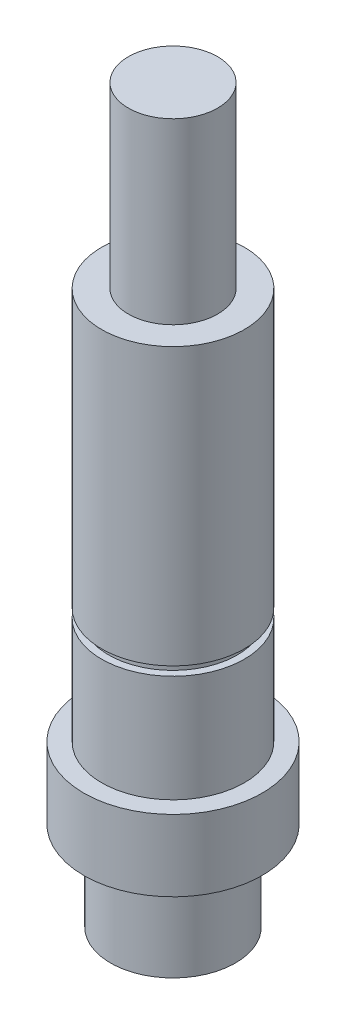
ISO-10303-21;
HEADER;
FILE_DESCRIPTION(('STEP AP214'),'2;1');
FILE_NAME('part.step','',(''),(''),'','','');
FILE_SCHEMA(('AUTOMOTIVE_DESIGN { 1 0 10303 214 1 1 1 1 }'));
ENDSEC;
DATA;
#1=APPLICATION_CONTEXT('core data for automotive mechanical design processes');
#2=APPLICATION_PROTOCOL_DEFINITION('international standard','automotive_design',2000,#1);
#3=PRODUCT_CONTEXT('',#1,'mechanical');
#4=PRODUCT('Part','Part','',(#3));
#5=PRODUCT_RELATED_PRODUCT_CATEGORY('part','',(#4));
#6=PRODUCT_DEFINITION_FORMATION('','',#4);
#7=PRODUCT_DEFINITION_CONTEXT('part definition',#1,'design');
#8=PRODUCT_DEFINITION('design','',#6,#7);
#9=PRODUCT_DEFINITION_SHAPE('','',#8);
#10=(LENGTH_UNIT() NAMED_UNIT(*) SI_UNIT(.MILLI.,.METRE.));
#11=(NAMED_UNIT(*) PLANE_ANGLE_UNIT() SI_UNIT($,.RADIAN.));
#12=(NAMED_UNIT(*) SI_UNIT($,.STERADIAN.) SOLID_ANGLE_UNIT());
#13=UNCERTAINTY_MEASURE_WITH_UNIT(LENGTH_MEASURE(1.E-05),#10,'distance_accuracy_value','');
#14=(GEOMETRIC_REPRESENTATION_CONTEXT(3) GLOBAL_UNCERTAINTY_ASSIGNED_CONTEXT((#13)) GLOBAL_UNIT_ASSIGNED_CONTEXT((#10,
#11,#12)) REPRESENTATION_CONTEXT('',''));
#15=CARTESIAN_POINT('',(0.,0.,0.));
#16=DIRECTION('',(0.,0.,1.));
#17=DIRECTION('',(1.,0.,0.));
#18=AXIS2_PLACEMENT_3D('',#15,#16,#17);
#19=CARTESIAN_POINT('',(-2.4451521004791,34.1954022988506,0.));
#20=DIRECTION('',(0.,-1.,0.));
#21=DIRECTION('',(0.,0.,-1.));
#22=AXIS2_PLACEMENT_3D('',#19,#20,#21);
#23=PLANE('',#22);
#24=CARTESIAN_POINT('',(0.054847899520899,34.1954022988506,0.));
#25=DIRECTION('',(0.,-1.,0.));
#26=DIRECTION('',(0.,0.,-1.));
#27=AXIS2_PLACEMENT_3D('',#24,#25,#26);
#28=CIRCLE('',#27,2.5);
#29=CARTESIAN_POINT('',(0.054847899520899,34.1954022988506,-2.5));
#30=VERTEX_POINT('',#29);
#31=EDGE_CURVE('E10',#30,#30,#28,.T.);
#32=ORIENTED_EDGE('',*,*,#31,.F.);
#33=EDGE_LOOP('',(#32));
#34=FACE_BOUND('',#33,.T.);
#35=ADVANCED_FACE('F31',(#34),#23,.F.);
#36=CARTESIAN_POINT('',(0.054847899520899,-6.80459770114942,0.));
#37=DIRECTION('',(0.,-1.,0.));
#38=DIRECTION('',(0.,0.,-1.));
#39=AXIS2_PLACEMENT_3D('',#36,#37,#38);
#40=CYLINDRICAL_SURFACE('',#39,2.5);
#41=CARTESIAN_POINT('',(0.054847899520899,24.1954022988506,0.));
#42=DIRECTION('',(0.,-1.,0.));
#43=DIRECTION('',(0.,0.,-1.));
#44=AXIS2_PLACEMENT_3D('',#41,#42,#43);
#45=CIRCLE('',#44,2.5);
#46=CARTESIAN_POINT('',(0.054847899520899,24.1954022988506,-2.5));
#47=VERTEX_POINT('',#46);
#48=EDGE_CURVE('E37',#47,#47,#45,.T.);
#49=ORIENTED_EDGE('',*,*,#48,.F.);
#50=EDGE_LOOP('',(#49));
#51=FACE_BOUND('',#50,.T.);
#52=ORIENTED_EDGE('',*,*,#31,.T.);
#53=EDGE_LOOP('',(#52));
#54=FACE_BOUND('',#53,.T.);
#55=ADVANCED_FACE('F133',(#51,#54),#40,.T.);
#56=CARTESIAN_POINT('',(-2.4451521004791,24.1954022988506,0.));
#57=DIRECTION('',(0.,-1.,0.));
#58=DIRECTION('',(0.,0.,-1.));
#59=AXIS2_PLACEMENT_3D('',#56,#57,#58);
#60=PLANE('',#59);
#61=CARTESIAN_POINT('',(0.054847899520899,24.1954022988506,0.));
#62=DIRECTION('',(0.,-1.,0.));
#63=DIRECTION('',(0.,0.,-1.));
#64=AXIS2_PLACEMENT_3D('',#61,#62,#63);
#65=CIRCLE('',#64,4.);
#66=CARTESIAN_POINT('',(0.054847899520899,24.1954022988506,-4.));
#67=VERTEX_POINT('',#66);
#68=EDGE_CURVE('E41',#67,#67,#65,.T.);
#69=ORIENTED_EDGE('',*,*,#68,.F.);
#70=EDGE_LOOP('',(#69));
#71=FACE_BOUND('',#70,.T.);
#72=ORIENTED_EDGE('',*,*,#48,.T.);
#73=EDGE_LOOP('',(#72));
#74=FACE_BOUND('',#73,.T.);
#75=ADVANCED_FACE('F128',(#71,#74),#60,.F.);
#76=CARTESIAN_POINT('',(0.054847899520899,-6.80459770114942,0.));
#77=DIRECTION('',(0.,-1.,0.));
#78=DIRECTION('',(0.,0.,-1.));
#79=AXIS2_PLACEMENT_3D('',#76,#77,#78);
#80=CYLINDRICAL_SURFACE('',#79,4.);
#81=CARTESIAN_POINT('',(0.054847899520899,8.69540229885058,0.));
#82=DIRECTION('',(0.,-1.,0.));
#83=DIRECTION('',(0.,0.,-1.));
#84=AXIS2_PLACEMENT_3D('',#81,#82,#83);
#85=CIRCLE('',#84,4.);
#86=CARTESIAN_POINT('',(0.054847899520899,8.69540229885058,-4.));
#87=VERTEX_POINT('',#86);
#88=EDGE_CURVE('E45',#87,#87,#85,.T.);
#89=ORIENTED_EDGE('',*,*,#88,.F.);
#90=EDGE_LOOP('',(#89));
#91=FACE_BOUND('',#90,.T.);
#92=ORIENTED_EDGE('',*,*,#68,.T.);
#93=EDGE_LOOP('',(#92));
#94=FACE_BOUND('',#93,.T.);
#95=ADVANCED_FACE('F122',(#91,#94),#80,.T.);
#96=CARTESIAN_POINT('',(-3.5451521004791,8.69540229885058,0.));
#97=DIRECTION('',(0.,1.,0.));
#98=DIRECTION('',(0.,0.,1.));
#99=AXIS2_PLACEMENT_3D('',#96,#97,#98);
#100=PLANE('',#99);
#101=CARTESIAN_POINT('',(0.054847899520899,8.69540229885058,0.));
#102=DIRECTION('',(0.,-1.,0.));
#103=DIRECTION('',(0.,0.,-1.));
#104=AXIS2_PLACEMENT_3D('',#101,#102,#103);
#105=CIRCLE('',#104,3.6);
#106=CARTESIAN_POINT('',(0.054847899520899,8.69540229885058,-3.6));
#107=VERTEX_POINT('',#106);
#108=EDGE_CURVE('E50',#107,#107,#105,.T.);
#109=ORIENTED_EDGE('',*,*,#108,.F.);
#110=EDGE_LOOP('',(#109));
#111=FACE_BOUND('',#110,.T.);
#112=ORIENTED_EDGE('',*,*,#88,.T.);
#113=EDGE_LOOP('',(#112));
#114=FACE_BOUND('',#113,.T.);
#115=ADVANCED_FACE('F116',(#111,#114),#100,.F.);
#116=CARTESIAN_POINT('',(0.054847899520899,-6.80459770114942,0.));
#117=DIRECTION('',(0.,-1.,0.));
#118=DIRECTION('',(0.,0.,-1.));
#119=AXIS2_PLACEMENT_3D('',#116,#117,#118);
#120=CYLINDRICAL_SURFACE('',#119,3.6);
#121=CARTESIAN_POINT('',(0.054847899520899,8.19540229885058,0.));
#122=DIRECTION('',(0.,-1.,0.));
#123=DIRECTION('',(0.,0.,-1.));
#124=AXIS2_PLACEMENT_3D('',#121,#122,#123);
#125=CIRCLE('',#124,3.6);
#126=CARTESIAN_POINT('',(0.054847899520899,8.19540229885058,-3.6));
#127=VERTEX_POINT('',#126);
#128=EDGE_CURVE('E53',#127,#127,#125,.T.);
#129=ORIENTED_EDGE('',*,*,#128,.F.);
#130=EDGE_LOOP('',(#129));
#131=FACE_BOUND('',#130,.T.);
#132=ORIENTED_EDGE('',*,*,#108,.T.);
#133=EDGE_LOOP('',(#132));
#134=FACE_BOUND('',#133,.T.);
#135=ADVANCED_FACE('F110',(#131,#134),#120,.T.);
#136=CARTESIAN_POINT('',(-3.9451521004791,8.19540229885058,0.));
#137=DIRECTION('',(0.,-1.,0.));
#138=DIRECTION('',(0.,0.,-1.));
#139=AXIS2_PLACEMENT_3D('',#136,#137,#138);
#140=PLANE('',#139);
#141=CARTESIAN_POINT('',(0.054847899520899,8.19540229885058,0.));
#142=DIRECTION('',(0.,-1.,0.));
#143=DIRECTION('',(0.,0.,-1.));
#144=AXIS2_PLACEMENT_3D('',#141,#142,#143);
#145=CIRCLE('',#144,4.);
#146=CARTESIAN_POINT('',(0.054847899520899,8.19540229885058,-4.));
#147=VERTEX_POINT('',#146);
#148=EDGE_CURVE('E56',#147,#147,#145,.T.);
#149=ORIENTED_EDGE('',*,*,#148,.F.);
#150=EDGE_LOOP('',(#149));
#151=FACE_BOUND('',#150,.T.);
#152=ORIENTED_EDGE('',*,*,#128,.T.);
#153=EDGE_LOOP('',(#152));
#154=FACE_BOUND('',#153,.T.);
#155=ADVANCED_FACE('F104',(#151,#154),#140,.F.);
#156=CARTESIAN_POINT('',(0.054847899520899,-6.80459770114942,0.));
#157=DIRECTION('',(0.,-1.,0.));
#158=DIRECTION('',(0.,0.,-1.));
#159=AXIS2_PLACEMENT_3D('',#156,#157,#158);
#160=CYLINDRICAL_SURFACE('',#159,4.);
#161=CARTESIAN_POINT('',(0.054847899520899,2.19540229885058,0.));
#162=DIRECTION('',(0.,-1.,0.));
#163=DIRECTION('',(0.,0.,-1.));
#164=AXIS2_PLACEMENT_3D('',#161,#162,#163);
#165=CIRCLE('',#164,4.);
#166=CARTESIAN_POINT('',(0.054847899520899,2.19540229885058,-4.));
#167=VERTEX_POINT('',#166);
#168=EDGE_CURVE('E59',#167,#167,#165,.T.);
#169=ORIENTED_EDGE('',*,*,#168,.F.);
#170=EDGE_LOOP('',(#169));
#171=FACE_BOUND('',#170,.T.);
#172=ORIENTED_EDGE('',*,*,#148,.T.);
#173=EDGE_LOOP('',(#172));
#174=FACE_BOUND('',#173,.T.);
#175=ADVANCED_FACE('F98',(#171,#174),#160,.T.);
#176=CARTESIAN_POINT('',(-3.9451521004791,2.19540229885058,0.));
#177=DIRECTION('',(0.,-1.,0.));
#178=DIRECTION('',(0.,0.,-1.));
#179=AXIS2_PLACEMENT_3D('',#176,#177,#178);
#180=PLANE('',#179);
#181=CARTESIAN_POINT('',(0.054847899520899,2.19540229885058,0.));
#182=DIRECTION('',(0.,-1.,0.));
#183=DIRECTION('',(0.,0.,-1.));
#184=AXIS2_PLACEMENT_3D('',#181,#182,#183);
#185=CIRCLE('',#184,5.);
#186=CARTESIAN_POINT('',(0.054847899520899,2.19540229885058,-5.));
#187=VERTEX_POINT('',#186);
#188=EDGE_CURVE('E62',#187,#187,#185,.T.);
#189=ORIENTED_EDGE('',*,*,#188,.F.);
#190=EDGE_LOOP('',(#189));
#191=FACE_BOUND('',#190,.T.);
#192=ORIENTED_EDGE('',*,*,#168,.T.);
#193=EDGE_LOOP('',(#192));
#194=FACE_BOUND('',#193,.T.);
#195=ADVANCED_FACE('F92',(#191,#194),#180,.F.);
#196=CARTESIAN_POINT('',(0.054847899520899,-6.80459770114942,0.));
#197=DIRECTION('',(0.,-1.,0.));
#198=DIRECTION('',(0.,0.,-1.));
#199=AXIS2_PLACEMENT_3D('',#196,#197,#198);
#200=CYLINDRICAL_SURFACE('',#199,5.);
#201=CARTESIAN_POINT('',(0.054847899520899,-1.80459770114942,0.));
#202=DIRECTION('',(0.,-1.,0.));
#203=DIRECTION('',(0.,0.,-1.));
#204=AXIS2_PLACEMENT_3D('',#201,#202,#203);
#205=CIRCLE('',#204,5.);
#206=CARTESIAN_POINT('',(0.054847899520899,-1.80459770114942,-5.));
#207=VERTEX_POINT('',#206);
#208=EDGE_CURVE('E65',#207,#207,#205,.T.);
#209=ORIENTED_EDGE('',*,*,#208,.F.);
#210=EDGE_LOOP('',(#209));
#211=FACE_BOUND('',#210,.T.);
#212=ORIENTED_EDGE('',*,*,#188,.T.);
#213=EDGE_LOOP('',(#212));
#214=FACE_BOUND('',#213,.T.);
#215=ADVANCED_FACE('F86',(#211,#214),#200,.T.);
#216=CARTESIAN_POINT('',(-4.9451521004791,-1.80459770114942,0.));
#217=DIRECTION('',(0.,1.,0.));
#218=DIRECTION('',(0.,0.,1.));
#219=AXIS2_PLACEMENT_3D('',#216,#217,#218);
#220=PLANE('',#219);
#221=CARTESIAN_POINT('',(0.054847899520899,-1.80459770114942,0.));
#222=DIRECTION('',(0.,-1.,0.));
#223=DIRECTION('',(0.,0.,-1.));
#224=AXIS2_PLACEMENT_3D('',#221,#222,#223);
#225=CIRCLE('',#224,3.5);
#226=CARTESIAN_POINT('',(0.054847899520899,-1.80459770114942,-3.5));
#227=VERTEX_POINT('',#226);
#228=EDGE_CURVE('E68',#227,#227,#225,.T.);
#229=ORIENTED_EDGE('',*,*,#228,.F.);
#230=EDGE_LOOP('',(#229));
#231=FACE_BOUND('',#230,.T.);
#232=ORIENTED_EDGE('',*,*,#208,.T.);
#233=EDGE_LOOP('',(#232));
#234=FACE_BOUND('',#233,.T.);
#235=ADVANCED_FACE('F80',(#231,#234),#220,.F.);
#236=CARTESIAN_POINT('',(0.054847899520899,-6.80459770114942,0.));
#237=DIRECTION('',(0.,-1.,0.));
#238=DIRECTION('',(0.,0.,-1.));
#239=AXIS2_PLACEMENT_3D('',#236,#237,#238);
#240=CYLINDRICAL_SURFACE('',#239,3.5);
#241=CARTESIAN_POINT('',(0.054847899520899,-6.80459770114942,0.));
#242=DIRECTION('',(0.,-1.,0.));
#243=DIRECTION('',(0.,0.,-1.));
#244=AXIS2_PLACEMENT_3D('',#241,#242,#243);
#245=CIRCLE('',#244,3.5);
#246=CARTESIAN_POINT('',(0.054847899520899,-6.80459770114942,-3.5));
#247=VERTEX_POINT('',#246);
#248=EDGE_CURVE('E71',#247,#247,#245,.T.);
#249=ORIENTED_EDGE('',*,*,#248,.F.);
#250=EDGE_LOOP('',(#249));
#251=FACE_BOUND('',#250,.T.);
#252=ORIENTED_EDGE('',*,*,#228,.T.);
#253=EDGE_LOOP('',(#252));
#254=FACE_BOUND('',#253,.T.);
#255=ADVANCED_FACE('F77',(#251,#254),#240,.T.);
#256=CARTESIAN_POINT('',(-3.4451521004791,-6.80459770114942,0.));
#257=DIRECTION('',(0.,1.,0.));
#258=DIRECTION('',(0.,0.,1.));
#259=AXIS2_PLACEMENT_3D('',#256,#257,#258);
#260=PLANE('',#259);
#261=ORIENTED_EDGE('',*,*,#248,.T.);
#262=EDGE_LOOP('',(#261));
#263=FACE_BOUND('',#262,.T.);
#264=ADVANCED_FACE('F75',(#263),#260,.F.);
#265=CLOSED_SHELL('',(#35,#55,#75,#95,#115,#135,#155,#175,#195,#215,#235,#255,#264));
#266=MANIFOLD_SOLID_BREP('B2',#265);
#267=ADVANCED_BREP_SHAPE_REPRESENTATION('',(#18,#266),#14);
#268=SHAPE_DEFINITION_REPRESENTATION(#9,#267);
ENDSEC;
END-ISO-10303-21;
